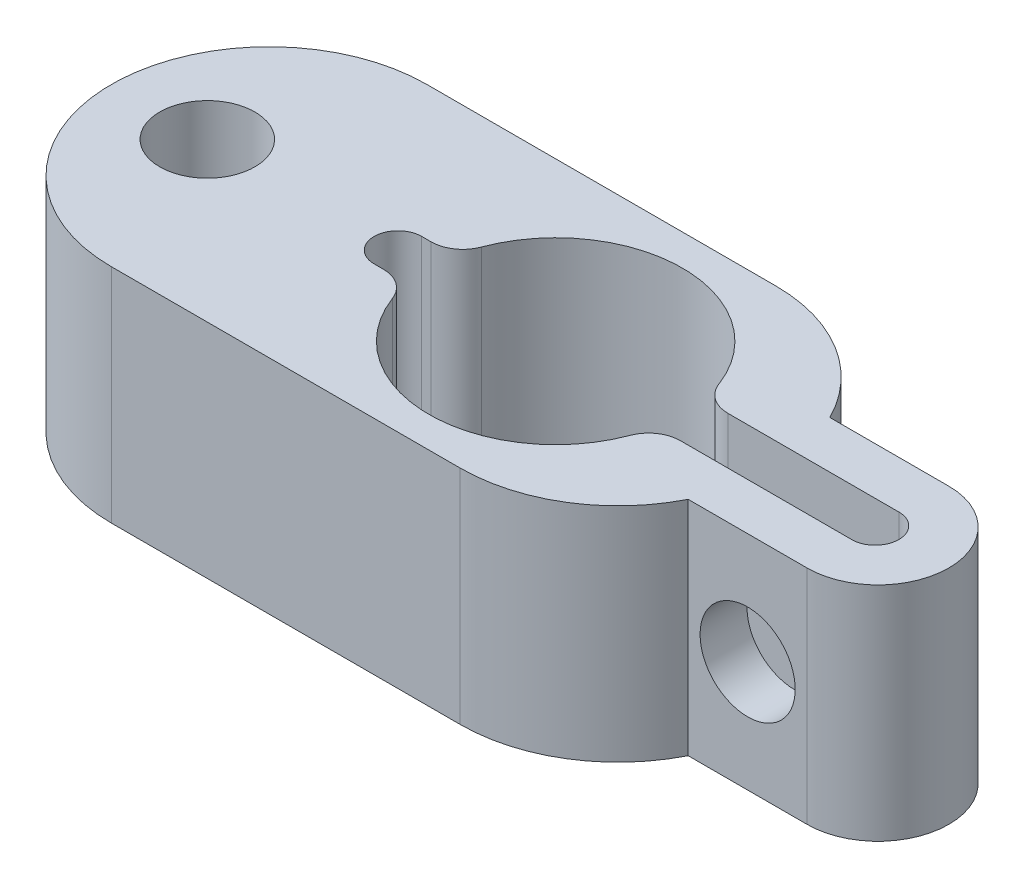
ISO-10303-21;
HEADER;
FILE_DESCRIPTION(('STEP AP214'),'2;1');
FILE_NAME('part.step','',(''),(''),'','','');
FILE_SCHEMA(('AUTOMOTIVE_DESIGN { 1 0 10303 214 1 1 1 1 }'));
ENDSEC;
DATA;
#1=APPLICATION_CONTEXT('core data for automotive mechanical design processes');
#2=APPLICATION_PROTOCOL_DEFINITION('international standard','automotive_design',2000,#1);
#3=PRODUCT_CONTEXT('',#1,'mechanical');
#4=PRODUCT('Part','Part','',(#3));
#5=PRODUCT_RELATED_PRODUCT_CATEGORY('part','',(#4));
#6=PRODUCT_DEFINITION_FORMATION('','',#4);
#7=PRODUCT_DEFINITION_CONTEXT('part definition',#1,'design');
#8=PRODUCT_DEFINITION('design','',#6,#7);
#9=PRODUCT_DEFINITION_SHAPE('','',#8);
#10=(LENGTH_UNIT() NAMED_UNIT(*) SI_UNIT(.MILLI.,.METRE.));
#11=(NAMED_UNIT(*) PLANE_ANGLE_UNIT() SI_UNIT($,.RADIAN.));
#12=(NAMED_UNIT(*) SI_UNIT($,.STERADIAN.) SOLID_ANGLE_UNIT());
#13=UNCERTAINTY_MEASURE_WITH_UNIT(LENGTH_MEASURE(1.E-05),#10,'distance_accuracy_value','');
#14=(GEOMETRIC_REPRESENTATION_CONTEXT(3) GLOBAL_UNCERTAINTY_ASSIGNED_CONTEXT((#13)) GLOBAL_UNIT_ASSIGNED_CONTEXT((#10,
#11,#12)) REPRESENTATION_CONTEXT('',''));
#15=CARTESIAN_POINT('',(0.,0.,0.));
#16=DIRECTION('',(0.,0.,1.));
#17=DIRECTION('',(1.,0.,0.));
#18=AXIS2_PLACEMENT_3D('',#15,#16,#17);
#19=CARTESIAN_POINT('',(-23.9579369166048,7.,0.));
#20=DIRECTION('',(0.,-1.,0.));
#21=DIRECTION('',(0.,0.,-1.));
#22=AXIS2_PLACEMENT_3D('',#19,#20,#21);
#23=CYLINDRICAL_SURFACE('',#22,4.97391267674292);
#24=CARTESIAN_POINT('',(-23.9579369166048,0.,0.));
#25=DIRECTION('',(0.,1.,0.));
#26=DIRECTION('',(0.,0.,1.));
#27=AXIS2_PLACEMENT_3D('',#24,#25,#26);
#28=CIRCLE('',#27,4.97391267674292);
#29=CARTESIAN_POINT('',(-19.5137803889829,0.,-2.23366964295527));
#30=VERTEX_POINT('',#29);
#31=CARTESIAN_POINT('',(-23.9579369166048,0.,-4.97391267674291));
#32=VERTEX_POINT('',#31);
#33=EDGE_CURVE('E193',#30,#32,#28,.T.);
#34=ORIENTED_EDGE('',*,*,#33,.T.);
#35=DIRECTION('',(0.,-1.,0.));
#36=VECTOR('',#35,1.);
#37=CARTESIAN_POINT('',(-23.9579369166048,7.,-4.97391267674291));
#38=LINE('',#37,#36);
#39=CARTESIAN_POINT('',(-23.9579369166048,7.,-4.97391267674291));
#40=VERTEX_POINT('',#39);
#41=EDGE_CURVE('E11',#40,#32,#38,.T.);
#42=ORIENTED_EDGE('',*,*,#41,.F.);
#43=CARTESIAN_POINT('',(-23.9579369166048,7.,0.));
#44=DIRECTION('',(0.,1.,0.));
#45=DIRECTION('',(0.,0.,1.));
#46=AXIS2_PLACEMENT_3D('',#43,#44,#45);
#47=CIRCLE('',#46,4.97391267674292);
#48=CARTESIAN_POINT('',(-19.5137803889829,7.,-2.23366964295527));
#49=VERTEX_POINT('',#48);
#50=EDGE_CURVE('E280',#49,#40,#47,.T.);
#51=ORIENTED_EDGE('',*,*,#50,.F.);
#52=DIRECTION('',(0.,-1.,0.));
#53=VECTOR('',#52,1.);
#54=CARTESIAN_POINT('',(-19.5137803889829,7.,-2.23366964295527));
#55=LINE('',#54,#53);
#56=EDGE_CURVE('E298',#49,#30,#55,.T.);
#57=ORIENTED_EDGE('',*,*,#56,.T.);
#58=EDGE_LOOP('',(#34,#42,#51,#57));
#59=FACE_BOUND('',#58,.T.);
#60=ADVANCED_FACE('F40',(#59),#23,.T.);
#61=CARTESIAN_POINT('',(-34.9579369166048,7.,-4.97391267674291));
#62=DIRECTION('',(0.,0.,1.));
#63=DIRECTION('',(1.,0.,0.));
#64=AXIS2_PLACEMENT_3D('',#61,#62,#63);
#65=PLANE('',#64);
#66=DIRECTION('',(-1.,0.,0.));
#67=VECTOR('',#66,1.);
#68=CARTESIAN_POINT('',(-34.9579369166048,0.,-4.97391267674291));
#69=LINE('',#68,#67);
#70=CARTESIAN_POINT('',(-34.9579369166048,0.,-4.97391267674291));
#71=VERTEX_POINT('',#70);
#72=EDGE_CURVE('E301',#32,#71,#69,.T.);
#73=ORIENTED_EDGE('',*,*,#72,.T.);
#74=DIRECTION('',(0.,-1.,0.));
#75=VECTOR('',#74,1.);
#76=CARTESIAN_POINT('',(-34.9579369166048,7.,-4.97391267674291));
#77=LINE('',#76,#75);
#78=CARTESIAN_POINT('',(-34.9579369166048,7.,-4.97391267674291));
#79=VERTEX_POINT('',#78);
#80=EDGE_CURVE('E48',#79,#71,#77,.T.);
#81=ORIENTED_EDGE('',*,*,#80,.F.);
#82=DIRECTION('',(-1.,0.,0.));
#83=VECTOR('',#82,1.);
#84=CARTESIAN_POINT('',(-34.9579369166048,7.,-4.97391267674291));
#85=LINE('',#84,#83);
#86=EDGE_CURVE('E283',#40,#79,#85,.T.);
#87=ORIENTED_EDGE('',*,*,#86,.F.);
#88=ORIENTED_EDGE('',*,*,#41,.T.);
#89=EDGE_LOOP('',(#73,#81,#87,#88));
#90=FACE_BOUND('',#89,.T.);
#91=ADVANCED_FACE('F358',(#90),#65,.F.);
#92=CARTESIAN_POINT('',(-34.9579369166048,7.,0.));
#93=DIRECTION('',(0.,-1.,0.));
#94=DIRECTION('',(0.,0.,-1.));
#95=AXIS2_PLACEMENT_3D('',#92,#93,#94);
#96=CYLINDRICAL_SURFACE('',#95,4.97391267674292);
#97=CARTESIAN_POINT('',(-34.9579369166048,0.,0.));
#98=DIRECTION('',(0.,1.,0.));
#99=DIRECTION('',(0.,0.,1.));
#100=AXIS2_PLACEMENT_3D('',#97,#98,#99);
#101=CIRCLE('',#100,4.97391267674292);
#102=CARTESIAN_POINT('',(-34.9579369166048,0.,4.97391267674293));
#103=VERTEX_POINT('',#102);
#104=EDGE_CURVE('E303',#71,#103,#101,.T.);
#105=ORIENTED_EDGE('',*,*,#104,.T.);
#106=DIRECTION('',(0.,-1.,0.));
#107=VECTOR('',#106,1.);
#108=CARTESIAN_POINT('',(-34.9579369166048,7.,4.97391267674293));
#109=LINE('',#108,#107);
#110=CARTESIAN_POINT('',(-34.9579369166048,7.,4.97391267674293));
#111=VERTEX_POINT('',#110);
#112=EDGE_CURVE('E328',#111,#103,#109,.T.);
#113=ORIENTED_EDGE('',*,*,#112,.F.);
#114=CARTESIAN_POINT('',(-34.9579369166048,7.,0.));
#115=DIRECTION('',(0.,1.,0.));
#116=DIRECTION('',(0.,0.,1.));
#117=AXIS2_PLACEMENT_3D('',#114,#115,#116);
#118=CIRCLE('',#117,4.97391267674292);
#119=EDGE_CURVE('E286',#79,#111,#118,.T.);
#120=ORIENTED_EDGE('',*,*,#119,.F.);
#121=ORIENTED_EDGE('',*,*,#80,.T.);
#122=EDGE_LOOP('',(#105,#113,#120,#121));
#123=FACE_BOUND('',#122,.T.);
#124=ADVANCED_FACE('F336',(#123),#96,.T.);
#125=CARTESIAN_POINT('',(-34.9579369166048,7.,4.97391267674293));
#126=DIRECTION('',(0.,0.,-1.));
#127=DIRECTION('',(-1.,0.,0.));
#128=AXIS2_PLACEMENT_3D('',#125,#126,#127);
#129=PLANE('',#128);
#130=DIRECTION('',(1.,0.,0.));
#131=VECTOR('',#130,1.);
#132=CARTESIAN_POINT('',(-34.9579369166048,0.,4.97391267674293));
#133=LINE('',#132,#131);
#134=CARTESIAN_POINT('',(-23.9579369166048,0.,4.97391267674293));
#135=VERTEX_POINT('',#134);
#136=EDGE_CURVE('E305',#103,#135,#133,.T.);
#137=ORIENTED_EDGE('',*,*,#136,.T.);
#138=DIRECTION('',(0.,-1.,0.));
#139=VECTOR('',#138,1.);
#140=CARTESIAN_POINT('',(-23.9579369166048,7.,4.97391267674293));
#141=LINE('',#140,#139);
#142=CARTESIAN_POINT('',(-23.9579369166048,7.,4.97391267674293));
#143=VERTEX_POINT('',#142);
#144=EDGE_CURVE('E325',#143,#135,#141,.T.);
#145=ORIENTED_EDGE('',*,*,#144,.F.);
#146=DIRECTION('',(1.,0.,0.));
#147=VECTOR('',#146,1.);
#148=CARTESIAN_POINT('',(-34.9579369166048,7.,4.97391267674293));
#149=LINE('',#148,#147);
#150=EDGE_CURVE('E288',#111,#143,#149,.T.);
#151=ORIENTED_EDGE('',*,*,#150,.F.);
#152=ORIENTED_EDGE('',*,*,#112,.T.);
#153=EDGE_LOOP('',(#137,#145,#151,#152));
#154=FACE_BOUND('',#153,.T.);
#155=ADVANCED_FACE('F347',(#154),#129,.F.);
#156=CARTESIAN_POINT('',(-23.9579369166048,7.,0.));
#157=DIRECTION('',(0.,-1.,0.));
#158=DIRECTION('',(0.,0.,-1.));
#159=AXIS2_PLACEMENT_3D('',#156,#157,#158);
#160=CYLINDRICAL_SURFACE('',#159,4.97391267674292);
#161=CARTESIAN_POINT('',(-23.9579369166048,0.,0.));
#162=DIRECTION('',(0.,1.,0.));
#163=DIRECTION('',(0.,0.,-1.));
#164=AXIS2_PLACEMENT_3D('',#161,#162,#163);
#165=CIRCLE('',#164,4.97391267674292);
#166=CARTESIAN_POINT('',(-19.5137803889829,0.,2.23366964295529));
#167=VERTEX_POINT('',#166);
#168=EDGE_CURVE('E307',#135,#167,#165,.T.);
#169=ORIENTED_EDGE('',*,*,#168,.T.);
#170=DIRECTION('',(0.,-1.,0.));
#171=VECTOR('',#170,1.);
#172=CARTESIAN_POINT('',(-19.5137803889829,7.,2.23366964295529));
#173=LINE('',#172,#171);
#174=CARTESIAN_POINT('',(-19.5137803889829,7.,2.23366964295529));
#175=VERTEX_POINT('',#174);
#176=EDGE_CURVE('E322',#175,#167,#173,.T.);
#177=ORIENTED_EDGE('',*,*,#176,.F.);
#178=CARTESIAN_POINT('',(-23.9579369166048,7.,0.));
#179=DIRECTION('',(0.,1.,0.));
#180=DIRECTION('',(0.,0.,-1.));
#181=AXIS2_PLACEMENT_3D('',#178,#179,#180);
#182=CIRCLE('',#181,4.97391267674292);
#183=EDGE_CURVE('E290',#143,#175,#182,.T.);
#184=ORIENTED_EDGE('',*,*,#183,.F.);
#185=ORIENTED_EDGE('',*,*,#144,.T.);
#186=EDGE_LOOP('',(#169,#177,#184,#185));
#187=FACE_BOUND('',#186,.T.);
#188=ADVANCED_FACE('F351',(#187),#160,.T.);
#189=CARTESIAN_POINT('',(-19.5137803889829,7.,2.23366964295529));
#190=DIRECTION('',(0.,0.,-1.));
#191=DIRECTION('',(-1.,0.,0.));
#192=AXIS2_PLACEMENT_3D('',#189,#190,#191);
#193=PLANE('',#192);
#194=CARTESIAN_POINT('',(-17.638780388983,3.5,2.23366964295528));
#195=DIRECTION('',(0.,0.,-1.));
#196=DIRECTION('',(-1.,0.,0.));
#197=AXIS2_PLACEMENT_3D('',#194,#195,#196);
#198=CIRCLE('',#197,1.5);
#199=CARTESIAN_POINT('',(-19.138780388983,3.5,2.23366964295529));
#200=VERTEX_POINT('',#199);
#201=EDGE_CURVE('E279',#200,#200,#198,.T.);
#202=ORIENTED_EDGE('',*,*,#201,.T.);
#203=EDGE_LOOP('',(#202));
#204=FACE_BOUND('',#203,.T.);
#205=DIRECTION('',(1.,0.,0.));
#206=VECTOR('',#205,1.);
#207=CARTESIAN_POINT('',(-19.5137803889829,0.,2.23366964295529));
#208=LINE('',#207,#206);
#209=CARTESIAN_POINT('',(-15.763780388983,0.,2.23366964295528));
#210=VERTEX_POINT('',#209);
#211=EDGE_CURVE('E309',#167,#210,#208,.T.);
#212=ORIENTED_EDGE('',*,*,#211,.T.);
#213=DIRECTION('',(0.,-1.,0.));
#214=VECTOR('',#213,1.);
#215=CARTESIAN_POINT('',(-15.763780388983,7.,2.23366964295528));
#216=LINE('',#215,#214);
#217=CARTESIAN_POINT('',(-15.763780388983,7.,2.23366964295528));
#218=VERTEX_POINT('',#217);
#219=EDGE_CURVE('E319',#218,#210,#216,.T.);
#220=ORIENTED_EDGE('',*,*,#219,.F.);
#221=DIRECTION('',(1.,0.,0.));
#222=VECTOR('',#221,1.);
#223=CARTESIAN_POINT('',(-19.5137803889829,7.,2.23366964295529));
#224=LINE('',#223,#222);
#225=EDGE_CURVE('E292',#175,#218,#224,.T.);
#226=ORIENTED_EDGE('',*,*,#225,.F.);
#227=ORIENTED_EDGE('',*,*,#176,.T.);
#228=EDGE_LOOP('',(#212,#220,#226,#227));
#229=FACE_BOUND('',#228,.T.);
#230=ADVANCED_FACE('F371',(#204,#229),#193,.F.);
#231=CARTESIAN_POINT('',(-15.763780388983,7.,0.));
#232=DIRECTION('',(0.,-1.,0.));
#233=DIRECTION('',(0.,0.,-1.));
#234=AXIS2_PLACEMENT_3D('',#231,#232,#233);
#235=CYLINDRICAL_SURFACE('',#234,2.23366964295527);
#236=CARTESIAN_POINT('',(-15.763780388983,0.,0.));
#237=DIRECTION('',(0.,1.,0.));
#238=DIRECTION('',(0.,0.,-1.));
#239=AXIS2_PLACEMENT_3D('',#236,#237,#238);
#240=CIRCLE('',#239,2.23366964295527);
#241=CARTESIAN_POINT('',(-15.763780388983,0.,-2.23366964295526));
#242=VERTEX_POINT('',#241);
#243=EDGE_CURVE('E311',#210,#242,#240,.T.);
#244=ORIENTED_EDGE('',*,*,#243,.T.);
#245=DIRECTION('',(0.,-1.,0.));
#246=VECTOR('',#245,1.);
#247=CARTESIAN_POINT('',(-15.763780388983,7.,-2.23366964295526));
#248=LINE('',#247,#246);
#249=CARTESIAN_POINT('',(-15.763780388983,7.,-2.23366964295526));
#250=VERTEX_POINT('',#249);
#251=EDGE_CURVE('E316',#250,#242,#248,.T.);
#252=ORIENTED_EDGE('',*,*,#251,.F.);
#253=CARTESIAN_POINT('',(-15.763780388983,7.,0.));
#254=DIRECTION('',(0.,1.,0.));
#255=DIRECTION('',(0.,0.,-1.));
#256=AXIS2_PLACEMENT_3D('',#253,#254,#255);
#257=CIRCLE('',#256,2.23366964295527);
#258=EDGE_CURVE('E294',#218,#250,#257,.T.);
#259=ORIENTED_EDGE('',*,*,#258,.F.);
#260=ORIENTED_EDGE('',*,*,#219,.T.);
#261=EDGE_LOOP('',(#244,#252,#259,#260));
#262=FACE_BOUND('',#261,.T.);
#263=ADVANCED_FACE('F369',(#262),#235,.T.);
#264=CARTESIAN_POINT('',(-19.5137803889829,7.,-2.23366964295527));
#265=DIRECTION('',(0.,0.,1.));
#266=DIRECTION('',(1.,0.,0.));
#267=AXIS2_PLACEMENT_3D('',#264,#265,#266);
#268=PLANE('',#267);
#269=CARTESIAN_POINT('',(-17.638780388983,3.5,-2.23366964295527));
#270=DIRECTION('',(0.,0.,-1.));
#271=DIRECTION('',(-1.,0.,0.));
#272=AXIS2_PLACEMENT_3D('',#269,#270,#271);
#273=CIRCLE('',#272,1.5);
#274=CARTESIAN_POINT('',(-19.138780388983,3.5,-2.23366964295527));
#275=VERTEX_POINT('',#274);
#276=EDGE_CURVE('E656',#275,#275,#273,.T.);
#277=ORIENTED_EDGE('',*,*,#276,.F.);
#278=EDGE_LOOP('',(#277));
#279=FACE_BOUND('',#278,.T.);
#280=DIRECTION('',(-1.,0.,0.));
#281=VECTOR('',#280,1.);
#282=CARTESIAN_POINT('',(-19.5137803889829,0.,-2.23366964295527));
#283=LINE('',#282,#281);
#284=EDGE_CURVE('E284',#242,#30,#283,.T.);
#285=ORIENTED_EDGE('',*,*,#284,.T.);
#286=ORIENTED_EDGE('',*,*,#56,.F.);
#287=DIRECTION('',(-1.,0.,0.));
#288=VECTOR('',#287,1.);
#289=CARTESIAN_POINT('',(-19.5137803889829,7.,-2.23366964295527));
#290=LINE('',#289,#288);
#291=EDGE_CURVE('E296',#250,#49,#290,.T.);
#292=ORIENTED_EDGE('',*,*,#291,.F.);
#293=ORIENTED_EDGE('',*,*,#251,.T.);
#294=EDGE_LOOP('',(#285,#286,#292,#293));
#295=FACE_BOUND('',#294,.T.);
#296=ADVANCED_FACE('F364',(#279,#295),#268,.F.);
#297=CARTESIAN_POINT('',(-23.9579369166048,7.,0.));
#298=DIRECTION('',(0.,1.,0.));
#299=DIRECTION('',(0.,0.,1.));
#300=AXIS2_PLACEMENT_3D('',#297,#298,#299);
#301=PLANE('',#300);
#302=DIRECTION('',(-1.,0.,0.));
#303=VECTOR('',#302,1.);
#304=CARTESIAN_POINT('',(-15.843921165916,7.,-0.741089379823582));
#305=LINE('',#304,#303);
#306=CARTESIAN_POINT('',(-15.843921165916,7.,-0.741089379823582));
#307=VERTEX_POINT('',#306);
#308=CARTESIAN_POINT('',(-21.2370801515324,7.,-0.741089379823581));
#309=VERTEX_POINT('',#308);
#310=EDGE_CURVE('E185',#307,#309,#305,.T.);
#311=ORIENTED_EDGE('',*,*,#310,.F.);
#312=CARTESIAN_POINT('',(-15.843921165916,7.,0.00891062017641825));
#313=DIRECTION('',(0.,1.,0.));
#314=DIRECTION('',(0.,0.,1.));
#315=AXIS2_PLACEMENT_3D('',#312,#313,#314);
#316=CIRCLE('',#315,0.750000000000001);
#317=CARTESIAN_POINT('',(-15.763780388983,7.,0.754616631867736));
#318=VERTEX_POINT('',#317);
#319=EDGE_CURVE('E177',#318,#307,#316,.T.);
#320=ORIENTED_EDGE('',*,*,#319,.F.);
#321=DIRECTION('',(1.,0.,0.));
#322=VECTOR('',#321,1.);
#323=CARTESIAN_POINT('',(-15.763780388983,7.,0.754616631867736));
#324=LINE('',#323,#322);
#325=CARTESIAN_POINT('',(-21.2377266569176,7.,0.754616631867737));
#326=VERTEX_POINT('',#325);
#327=EDGE_CURVE('E221',#326,#318,#324,.T.);
#328=ORIENTED_EDGE('',*,*,#327,.F.);
#329=CARTESIAN_POINT('',(-21.2377266569176,7.,1.75461663186774));
#330=DIRECTION('',(0.,-1.,0.));
#331=DIRECTION('',(0.,0.,1.));
#332=AXIS2_PLACEMENT_3D('',#329,#330,#331);
#333=CIRCLE('',#332,1.);
#334=CARTESIAN_POINT('',(-22.1744763566774,7.,1.40461663186774));
#335=VERTEX_POINT('',#334);
#336=EDGE_CURVE('E219',#335,#326,#333,.T.);
#337=ORIENTED_EDGE('',*,*,#336,.F.);
#338=CARTESIAN_POINT('',(-25.918050981137,7.,0.00589601429305532));
#339=DIRECTION('',(0.,1.,0.));
#340=DIRECTION('',(0.,0.,-1.));
#341=AXIS2_PLACEMENT_3D('',#338,#339,#340);
#342=CIRCLE('',#341,3.99634462164195);
#343=CARTESIAN_POINT('',(-29.6612431011973,7.,1.40563995060606));
#344=VERTEX_POINT('',#343);
#345=EDGE_CURVE('E217',#344,#335,#342,.T.);
#346=ORIENTED_EDGE('',*,*,#345,.F.);
#347=CARTESIAN_POINT('',(-30.5978970873899,7.,1.75589601429306));
#348=DIRECTION('',(0.,-1.,0.));
#349=DIRECTION('',(0.,0.,-1.));
#350=AXIS2_PLACEMENT_3D('',#347,#348,#349);
#351=CIRCLE('',#350,1.);
#352=CARTESIAN_POINT('',(-30.5978970873899,7.,0.755896014293056));
#353=VERTEX_POINT('',#352);
#354=EDGE_CURVE('E215',#353,#344,#351,.T.);
#355=ORIENTED_EDGE('',*,*,#354,.F.);
#356=DIRECTION('',(1.,0.,0.));
#357=VECTOR('',#356,1.);
#358=CARTESIAN_POINT('',(-30.5978970873899,7.,0.755896014293056));
#359=LINE('',#358,#357);
#360=CARTESIAN_POINT('',(-30.8906440954293,7.,0.755896014293056));
#361=VERTEX_POINT('',#360);
#362=EDGE_CURVE('E213',#361,#353,#359,.T.);
#363=ORIENTED_EDGE('',*,*,#362,.F.);
#364=CARTESIAN_POINT('',(-30.8906440954293,7.,0.00589601429305596));
#365=DIRECTION('',(0.,1.,0.));
#366=DIRECTION('',(0.,0.,-1.));
#367=AXIS2_PLACEMENT_3D('',#364,#365,#366);
#368=CIRCLE('',#367,0.75);
#369=CARTESIAN_POINT('',(-30.8906440954293,7.,-0.744103985706944));
#370=VERTEX_POINT('',#369);
#371=EDGE_CURVE('E211',#370,#361,#368,.T.);
#372=ORIENTED_EDGE('',*,*,#371,.F.);
#373=DIRECTION('',(-1.,0.,0.));
#374=VECTOR('',#373,1.);
#375=CARTESIAN_POINT('',(-30.8906440954293,7.,-0.744103985706944));
#376=LINE('',#375,#374);
#377=CARTESIAN_POINT('',(-30.5978970873899,7.,-0.744103985706944));
#378=VERTEX_POINT('',#377);
#379=EDGE_CURVE('E209',#378,#370,#376,.T.);
#380=ORIENTED_EDGE('',*,*,#379,.F.);
#381=CARTESIAN_POINT('',(-30.5978970873899,7.,-1.74410398570694));
#382=DIRECTION('',(0.,-1.,0.));
#383=DIRECTION('',(0.,0.,1.));
#384=AXIS2_PLACEMENT_3D('',#381,#382,#383);
#385=CIRCLE('',#384,1.);
#386=CARTESIAN_POINT('',(-29.6612431011973,7.,-1.39384792201995));
#387=VERTEX_POINT('',#386);
#388=EDGE_CURVE('E207',#387,#378,#385,.T.);
#389=ORIENTED_EDGE('',*,*,#388,.F.);
#390=CARTESIAN_POINT('',(-25.918050981137,7.,0.00589601429305532));
#391=DIRECTION('',(0.,1.,0.));
#392=DIRECTION('',(0.,0.,1.));
#393=AXIS2_PLACEMENT_3D('',#390,#391,#392);
#394=CIRCLE('',#393,3.99634462164195);
#395=CARTESIAN_POINT('',(-22.1744763566774,7.,-1.39282460328163));
#396=VERTEX_POINT('',#395);
#397=EDGE_CURVE('E202',#396,#387,#394,.T.);
#398=ORIENTED_EDGE('',*,*,#397,.F.);
#399=CARTESIAN_POINT('',(-21.2370801515324,7.,-1.74108937982358));
#400=DIRECTION('',(0.,-1.,0.));
#401=DIRECTION('',(0.,0.,1.));
#402=AXIS2_PLACEMENT_3D('',#399,#400,#401);
#403=CIRCLE('',#402,1.);
#404=EDGE_CURVE('E200',#309,#396,#403,.T.);
#405=ORIENTED_EDGE('',*,*,#404,.F.);
#406=EDGE_LOOP('',(#311,#320,#328,#337,#346,#355,#363,#372,#380,#389,#398,#405));
#407=FACE_BOUND('',#406,.T.);
#408=CARTESIAN_POINT('',(-36.918050981137,7.,-0.0133436525686305));
#409=DIRECTION('',(0.,1.,0.));
#410=DIRECTION('',(0.,0.,1.));
#411=AXIS2_PLACEMENT_3D('',#408,#409,#410);
#412=CIRCLE('',#411,1.5);
#413=CARTESIAN_POINT('',(-36.918050981137,7.,1.48665634743137));
#414=VERTEX_POINT('',#413);
#415=EDGE_CURVE('E276',#414,#414,#412,.T.);
#416=ORIENTED_EDGE('',*,*,#415,.F.);
#417=EDGE_LOOP('',(#416));
#418=FACE_BOUND('',#417,.T.);
#419=ORIENTED_EDGE('',*,*,#50,.T.);
#420=ORIENTED_EDGE('',*,*,#86,.T.);
#421=ORIENTED_EDGE('',*,*,#119,.T.);
#422=ORIENTED_EDGE('',*,*,#150,.T.);
#423=ORIENTED_EDGE('',*,*,#183,.T.);
#424=ORIENTED_EDGE('',*,*,#225,.T.);
#425=ORIENTED_EDGE('',*,*,#258,.T.);
#426=ORIENTED_EDGE('',*,*,#291,.T.);
#427=EDGE_LOOP('',(#419,#420,#421,#422,#423,#424,#425,#426));
#428=FACE_BOUND('',#427,.T.);
#429=ADVANCED_FACE('F197',(#407,#418,#428),#301,.T.);
#430=CARTESIAN_POINT('',(-23.9579369166048,0.,0.));
#431=DIRECTION('',(0.,1.,0.));
#432=DIRECTION('',(0.,0.,1.));
#433=AXIS2_PLACEMENT_3D('',#430,#431,#432);
#434=PLANE('',#433);
#435=CARTESIAN_POINT('',(-15.843921165916,0.,0.00891062017641825));
#436=DIRECTION('',(0.,1.,0.));
#437=DIRECTION('',(0.,0.,1.));
#438=AXIS2_PLACEMENT_3D('',#435,#436,#437);
#439=CIRCLE('',#438,0.750000000000001);
#440=CARTESIAN_POINT('',(-15.763780388983,0.,0.754616631867736));
#441=VERTEX_POINT('',#440);
#442=CARTESIAN_POINT('',(-15.843921165916,0.,-0.741089379823582));
#443=VERTEX_POINT('',#442);
#444=EDGE_CURVE('E63',#441,#443,#439,.T.);
#445=ORIENTED_EDGE('',*,*,#444,.T.);
#446=DIRECTION('',(-1.,0.,0.));
#447=VECTOR('',#446,1.);
#448=CARTESIAN_POINT('',(-15.843921165916,0.,-0.741089379823582));
#449=LINE('',#448,#447);
#450=CARTESIAN_POINT('',(-21.2370801515324,0.,-0.741089379823581));
#451=VERTEX_POINT('',#450);
#452=EDGE_CURVE('E192',#443,#451,#449,.T.);
#453=ORIENTED_EDGE('',*,*,#452,.T.);
#454=CARTESIAN_POINT('',(-21.2370801515324,0.,-1.74108937982358));
#455=DIRECTION('',(0.,-1.,0.));
#456=DIRECTION('',(0.,0.,1.));
#457=AXIS2_PLACEMENT_3D('',#454,#455,#456);
#458=CIRCLE('',#457,1.);
#459=CARTESIAN_POINT('',(-22.1744763566774,0.,-1.39282460328163));
#460=VERTEX_POINT('',#459);
#461=EDGE_CURVE('E226',#451,#460,#458,.T.);
#462=ORIENTED_EDGE('',*,*,#461,.T.);
#463=CARTESIAN_POINT('',(-25.918050981137,0.,0.00589601429305532));
#464=DIRECTION('',(0.,1.,0.));
#465=DIRECTION('',(0.,0.,1.));
#466=AXIS2_PLACEMENT_3D('',#463,#464,#465);
#467=CIRCLE('',#466,3.99634462164195);
#468=CARTESIAN_POINT('',(-29.6612431011973,0.,-1.39384792201995));
#469=VERTEX_POINT('',#468);
#470=EDGE_CURVE('E229',#460,#469,#467,.T.);
#471=ORIENTED_EDGE('',*,*,#470,.T.);
#472=CARTESIAN_POINT('',(-30.5978970873899,0.,-1.74410398570694));
#473=DIRECTION('',(0.,-1.,0.));
#474=DIRECTION('',(0.,0.,1.));
#475=AXIS2_PLACEMENT_3D('',#472,#473,#474);
#476=CIRCLE('',#475,1.);
#477=CARTESIAN_POINT('',(-30.5978970873899,0.,-0.744103985706944));
#478=VERTEX_POINT('',#477);
#479=EDGE_CURVE('E232',#469,#478,#476,.T.);
#480=ORIENTED_EDGE('',*,*,#479,.T.);
#481=DIRECTION('',(-1.,0.,0.));
#482=VECTOR('',#481,1.);
#483=CARTESIAN_POINT('',(-30.8906440954293,0.,-0.744103985706944));
#484=LINE('',#483,#482);
#485=CARTESIAN_POINT('',(-30.8906440954293,0.,-0.744103985706944));
#486=VERTEX_POINT('',#485);
#487=EDGE_CURVE('E235',#478,#486,#484,.T.);
#488=ORIENTED_EDGE('',*,*,#487,.T.);
#489=CARTESIAN_POINT('',(-30.8906440954293,0.,0.00589601429305596));
#490=DIRECTION('',(0.,1.,0.));
#491=DIRECTION('',(0.,0.,-1.));
#492=AXIS2_PLACEMENT_3D('',#489,#490,#491);
#493=CIRCLE('',#492,0.75);
#494=CARTESIAN_POINT('',(-30.8906440954293,0.,0.755896014293056));
#495=VERTEX_POINT('',#494);
#496=EDGE_CURVE('E238',#486,#495,#493,.T.);
#497=ORIENTED_EDGE('',*,*,#496,.T.);
#498=DIRECTION('',(1.,0.,0.));
#499=VECTOR('',#498,1.);
#500=CARTESIAN_POINT('',(-30.5978970873899,0.,0.755896014293056));
#501=LINE('',#500,#499);
#502=CARTESIAN_POINT('',(-30.5978970873899,0.,0.755896014293056));
#503=VERTEX_POINT('',#502);
#504=EDGE_CURVE('E241',#495,#503,#501,.T.);
#505=ORIENTED_EDGE('',*,*,#504,.T.);
#506=CARTESIAN_POINT('',(-30.5978970873899,0.,1.75589601429306));
#507=DIRECTION('',(0.,-1.,0.));
#508=DIRECTION('',(0.,0.,-1.));
#509=AXIS2_PLACEMENT_3D('',#506,#507,#508);
#510=CIRCLE('',#509,1.);
#511=CARTESIAN_POINT('',(-29.6612431011973,0.,1.40563995060606));
#512=VERTEX_POINT('',#511);
#513=EDGE_CURVE('E244',#503,#512,#510,.T.);
#514=ORIENTED_EDGE('',*,*,#513,.T.);
#515=CARTESIAN_POINT('',(-25.918050981137,0.,0.00589601429305532));
#516=DIRECTION('',(0.,1.,0.));
#517=DIRECTION('',(0.,0.,-1.));
#518=AXIS2_PLACEMENT_3D('',#515,#516,#517);
#519=CIRCLE('',#518,3.99634462164195);
#520=CARTESIAN_POINT('',(-22.1744763566774,0.,1.40461663186774));
#521=VERTEX_POINT('',#520);
#522=EDGE_CURVE('E247',#512,#521,#519,.T.);
#523=ORIENTED_EDGE('',*,*,#522,.T.);
#524=CARTESIAN_POINT('',(-21.2377266569176,0.,1.75461663186774));
#525=DIRECTION('',(0.,-1.,0.));
#526=DIRECTION('',(0.,0.,1.));
#527=AXIS2_PLACEMENT_3D('',#524,#525,#526);
#528=CIRCLE('',#527,1.);
#529=CARTESIAN_POINT('',(-21.2377266569176,0.,0.754616631867737));
#530=VERTEX_POINT('',#529);
#531=EDGE_CURVE('E250',#521,#530,#528,.T.);
#532=ORIENTED_EDGE('',*,*,#531,.T.);
#533=DIRECTION('',(1.,0.,0.));
#534=VECTOR('',#533,1.);
#535=CARTESIAN_POINT('',(-15.763780388983,0.,0.754616631867736));
#536=LINE('',#535,#534);
#537=EDGE_CURVE('E186',#530,#441,#536,.T.);
#538=ORIENTED_EDGE('',*,*,#537,.T.);
#539=EDGE_LOOP('',(#445,#453,#462,#471,#480,#488,#497,#505,#514,#523,#532,#538));
#540=FACE_BOUND('',#539,.T.);
#541=CARTESIAN_POINT('',(-36.918050981137,0.,-0.0133436525686305));
#542=DIRECTION('',(0.,1.,0.));
#543=DIRECTION('',(0.,0.,1.));
#544=AXIS2_PLACEMENT_3D('',#541,#542,#543);
#545=CIRCLE('',#544,1.5);
#546=CARTESIAN_POINT('',(-36.918050981137,0.,1.48665634743137));
#547=VERTEX_POINT('',#546);
#548=EDGE_CURVE('E224',#547,#547,#545,.T.);
#549=ORIENTED_EDGE('',*,*,#548,.T.);
#550=EDGE_LOOP('',(#549));
#551=FACE_BOUND('',#550,.T.);
#552=ORIENTED_EDGE('',*,*,#33,.F.);
#553=ORIENTED_EDGE('',*,*,#284,.F.);
#554=ORIENTED_EDGE('',*,*,#243,.F.);
#555=ORIENTED_EDGE('',*,*,#211,.F.);
#556=ORIENTED_EDGE('',*,*,#168,.F.);
#557=ORIENTED_EDGE('',*,*,#136,.F.);
#558=ORIENTED_EDGE('',*,*,#104,.F.);
#559=ORIENTED_EDGE('',*,*,#72,.F.);
#560=EDGE_LOOP('',(#552,#553,#554,#555,#556,#557,#558,#559));
#561=FACE_BOUND('',#560,.T.);
#562=ADVANCED_FACE('F342',(#540,#551,#561),#434,.F.);
#563=CARTESIAN_POINT('',(-36.918050981137,7.,-0.0133436525686305));
#564=DIRECTION('',(0.,-1.,0.));
#565=DIRECTION('',(0.,0.,-1.));
#566=AXIS2_PLACEMENT_3D('',#563,#564,#565);
#567=CYLINDRICAL_SURFACE('',#566,1.5);
#568=ORIENTED_EDGE('',*,*,#415,.T.);
#569=EDGE_LOOP('',(#568));
#570=FACE_BOUND('',#569,.T.);
#571=ORIENTED_EDGE('',*,*,#548,.F.);
#572=EDGE_LOOP('',(#571));
#573=FACE_BOUND('',#572,.T.);
#574=ADVANCED_FACE('F429',(#570,#573),#567,.F.);
#575=CARTESIAN_POINT('',(-15.843921165916,7.,0.00891062017641825));
#576=DIRECTION('',(0.,-1.,0.));
#577=DIRECTION('',(0.,0.,-1.));
#578=AXIS2_PLACEMENT_3D('',#575,#576,#577);
#579=CYLINDRICAL_SURFACE('',#578,0.750000000000001);
#580=ORIENTED_EDGE('',*,*,#444,.F.);
#581=DIRECTION('',(0.,-1.,0.));
#582=VECTOR('',#581,1.);
#583=CARTESIAN_POINT('',(-15.763780388983,7.,0.754616631867736));
#584=LINE('',#583,#582);
#585=EDGE_CURVE('E181',#318,#441,#584,.T.);
#586=ORIENTED_EDGE('',*,*,#585,.F.);
#587=ORIENTED_EDGE('',*,*,#319,.T.);
#588=DIRECTION('',(0.,-1.,0.));
#589=VECTOR('',#588,1.);
#590=CARTESIAN_POINT('',(-15.843921165916,7.,-0.741089379823582));
#591=LINE('',#590,#589);
#592=EDGE_CURVE('E180',#307,#443,#591,.T.);
#593=ORIENTED_EDGE('',*,*,#592,.T.);
#594=EDGE_LOOP('',(#580,#586,#587,#593));
#595=FACE_BOUND('',#594,.T.);
#596=ADVANCED_FACE('F179',(#595),#579,.F.);
#597=CARTESIAN_POINT('',(-15.843921165916,7.,-0.741089379823582));
#598=DIRECTION('',(0.,0.,1.));
#599=DIRECTION('',(1.,0.,0.));
#600=AXIS2_PLACEMENT_3D('',#597,#598,#599);
#601=PLANE('',#600);
#602=CARTESIAN_POINT('',(-17.638780388983,3.5,-0.741089379823582));
#603=DIRECTION('',(0.,0.,1.));
#604=DIRECTION('',(1.,0.,0.));
#605=AXIS2_PLACEMENT_3D('',#602,#603,#604);
#606=CIRCLE('',#605,1.5);
#607=CARTESIAN_POINT('',(-16.138780388983,3.5,-0.741089379823582));
#608=VERTEX_POINT('',#607);
#609=EDGE_CURVE('E653',#608,#608,#606,.T.);
#610=ORIENTED_EDGE('',*,*,#609,.F.);
#611=EDGE_LOOP('',(#610));
#612=FACE_BOUND('',#611,.T.);
#613=ORIENTED_EDGE('',*,*,#452,.F.);
#614=ORIENTED_EDGE('',*,*,#592,.F.);
#615=ORIENTED_EDGE('',*,*,#310,.T.);
#616=DIRECTION('',(0.,-1.,0.));
#617=VECTOR('',#616,1.);
#618=CARTESIAN_POINT('',(-21.2370801515324,7.,-0.741089379823581));
#619=LINE('',#618,#617);
#620=EDGE_CURVE('E194',#309,#451,#619,.T.);
#621=ORIENTED_EDGE('',*,*,#620,.T.);
#622=EDGE_LOOP('',(#613,#614,#615,#621));
#623=FACE_BOUND('',#622,.T.);
#624=ADVANCED_FACE('F189',(#612,#623),#601,.T.);
#625=CARTESIAN_POINT('',(-21.2370801515324,7.,-1.74108937982358));
#626=DIRECTION('',(0.,-1.,0.));
#627=DIRECTION('',(0.,0.,-1.));
#628=AXIS2_PLACEMENT_3D('',#625,#626,#627);
#629=CYLINDRICAL_SURFACE('',#628,1.);
#630=ORIENTED_EDGE('',*,*,#461,.F.);
#631=ORIENTED_EDGE('',*,*,#620,.F.);
#632=ORIENTED_EDGE('',*,*,#404,.T.);
#633=DIRECTION('',(0.,-1.,0.));
#634=VECTOR('',#633,1.);
#635=CARTESIAN_POINT('',(-22.1744763566774,7.,-1.39282460328163));
#636=LINE('',#635,#634);
#637=EDGE_CURVE('E271',#396,#460,#636,.T.);
#638=ORIENTED_EDGE('',*,*,#637,.T.);
#639=EDGE_LOOP('',(#630,#631,#632,#638));
#640=FACE_BOUND('',#639,.T.);
#641=ADVANCED_FACE('F457',(#640),#629,.T.);
#642=CARTESIAN_POINT('',(-25.918050981137,7.,0.00589601429305532));
#643=DIRECTION('',(0.,-1.,0.));
#644=DIRECTION('',(0.,0.,-1.));
#645=AXIS2_PLACEMENT_3D('',#642,#643,#644);
#646=CYLINDRICAL_SURFACE('',#645,3.99634462164195);
#647=ORIENTED_EDGE('',*,*,#470,.F.);
#648=ORIENTED_EDGE('',*,*,#637,.F.);
#649=ORIENTED_EDGE('',*,*,#397,.T.);
#650=DIRECTION('',(0.,-1.,0.));
#651=VECTOR('',#650,1.);
#652=CARTESIAN_POINT('',(-29.6612431011973,7.,-1.39384792201995));
#653=LINE('',#652,#651);
#654=EDGE_CURVE('E269',#387,#469,#653,.T.);
#655=ORIENTED_EDGE('',*,*,#654,.T.);
#656=EDGE_LOOP('',(#647,#648,#649,#655));
#657=FACE_BOUND('',#656,.T.);
#658=ADVANCED_FACE('F462',(#657),#646,.F.);
#659=CARTESIAN_POINT('',(-30.5978970873899,7.,-1.74410398570694));
#660=DIRECTION('',(0.,-1.,0.));
#661=DIRECTION('',(0.,0.,-1.));
#662=AXIS2_PLACEMENT_3D('',#659,#660,#661);
#663=CYLINDRICAL_SURFACE('',#662,1.);
#664=ORIENTED_EDGE('',*,*,#479,.F.);
#665=ORIENTED_EDGE('',*,*,#654,.F.);
#666=ORIENTED_EDGE('',*,*,#388,.T.);
#667=DIRECTION('',(0.,-1.,0.));
#668=VECTOR('',#667,1.);
#669=CARTESIAN_POINT('',(-30.5978970873899,7.,-0.744103985706944));
#670=LINE('',#669,#668);
#671=EDGE_CURVE('E267',#378,#478,#670,.T.);
#672=ORIENTED_EDGE('',*,*,#671,.T.);
#673=EDGE_LOOP('',(#664,#665,#666,#672));
#674=FACE_BOUND('',#673,.T.);
#675=ADVANCED_FACE('F473',(#674),#663,.T.);
#676=CARTESIAN_POINT('',(-30.8906440954293,7.,-0.744103985706944));
#677=DIRECTION('',(0.,0.,1.));
#678=DIRECTION('',(1.,0.,0.));
#679=AXIS2_PLACEMENT_3D('',#676,#677,#678);
#680=PLANE('',#679);
#681=ORIENTED_EDGE('',*,*,#487,.F.);
#682=ORIENTED_EDGE('',*,*,#671,.F.);
#683=ORIENTED_EDGE('',*,*,#379,.T.);
#684=DIRECTION('',(0.,-1.,0.));
#685=VECTOR('',#684,1.);
#686=CARTESIAN_POINT('',(-30.8906440954293,7.,-0.744103985706944));
#687=LINE('',#686,#685);
#688=EDGE_CURVE('E265',#370,#486,#687,.T.);
#689=ORIENTED_EDGE('',*,*,#688,.T.);
#690=EDGE_LOOP('',(#681,#682,#683,#689));
#691=FACE_BOUND('',#690,.T.);
#692=ADVANCED_FACE('F484',(#691),#680,.T.);
#693=CARTESIAN_POINT('',(-30.8906440954293,7.,0.00589601429305596));
#694=DIRECTION('',(0.,-1.,0.));
#695=DIRECTION('',(0.,0.,-1.));
#696=AXIS2_PLACEMENT_3D('',#693,#694,#695);
#697=CYLINDRICAL_SURFACE('',#696,0.75);
#698=ORIENTED_EDGE('',*,*,#496,.F.);
#699=ORIENTED_EDGE('',*,*,#688,.F.);
#700=ORIENTED_EDGE('',*,*,#371,.T.);
#701=DIRECTION('',(0.,-1.,0.));
#702=VECTOR('',#701,1.);
#703=CARTESIAN_POINT('',(-30.8906440954293,7.,0.755896014293056));
#704=LINE('',#703,#702);
#705=EDGE_CURVE('E263',#361,#495,#704,.T.);
#706=ORIENTED_EDGE('',*,*,#705,.T.);
#707=EDGE_LOOP('',(#698,#699,#700,#706));
#708=FACE_BOUND('',#707,.T.);
#709=ADVANCED_FACE('F495',(#708),#697,.F.);
#710=CARTESIAN_POINT('',(-30.5978970873899,7.,0.755896014293056));
#711=DIRECTION('',(0.,0.,-1.));
#712=DIRECTION('',(-1.,0.,0.));
#713=AXIS2_PLACEMENT_3D('',#710,#711,#712);
#714=PLANE('',#713);
#715=ORIENTED_EDGE('',*,*,#504,.F.);
#716=ORIENTED_EDGE('',*,*,#705,.F.);
#717=ORIENTED_EDGE('',*,*,#362,.T.);
#718=DIRECTION('',(0.,-1.,0.));
#719=VECTOR('',#718,1.);
#720=CARTESIAN_POINT('',(-30.5978970873899,7.,0.755896014293056));
#721=LINE('',#720,#719);
#722=EDGE_CURVE('E261',#353,#503,#721,.T.);
#723=ORIENTED_EDGE('',*,*,#722,.T.);
#724=EDGE_LOOP('',(#715,#716,#717,#723));
#725=FACE_BOUND('',#724,.T.);
#726=ADVANCED_FACE('F506',(#725),#714,.T.);
#727=CARTESIAN_POINT('',(-30.5978970873899,7.,1.75589601429306));
#728=DIRECTION('',(0.,-1.,0.));
#729=DIRECTION('',(0.,0.,-1.));
#730=AXIS2_PLACEMENT_3D('',#727,#728,#729);
#731=CYLINDRICAL_SURFACE('',#730,1.);
#732=ORIENTED_EDGE('',*,*,#513,.F.);
#733=ORIENTED_EDGE('',*,*,#722,.F.);
#734=ORIENTED_EDGE('',*,*,#354,.T.);
#735=DIRECTION('',(0.,-1.,0.));
#736=VECTOR('',#735,1.);
#737=CARTESIAN_POINT('',(-29.6612431011973,7.,1.40563995060606));
#738=LINE('',#737,#736);
#739=EDGE_CURVE('E259',#344,#512,#738,.T.);
#740=ORIENTED_EDGE('',*,*,#739,.T.);
#741=EDGE_LOOP('',(#732,#733,#734,#740));
#742=FACE_BOUND('',#741,.T.);
#743=ADVANCED_FACE('F517',(#742),#731,.T.);
#744=CARTESIAN_POINT('',(-25.918050981137,7.,0.00589601429305532));
#745=DIRECTION('',(0.,-1.,0.));
#746=DIRECTION('',(0.,0.,-1.));
#747=AXIS2_PLACEMENT_3D('',#744,#745,#746);
#748=CYLINDRICAL_SURFACE('',#747,3.99634462164195);
#749=ORIENTED_EDGE('',*,*,#522,.F.);
#750=ORIENTED_EDGE('',*,*,#739,.F.);
#751=ORIENTED_EDGE('',*,*,#345,.T.);
#752=DIRECTION('',(0.,-1.,0.));
#753=VECTOR('',#752,1.);
#754=CARTESIAN_POINT('',(-22.1744763566774,7.,1.40461663186774));
#755=LINE('',#754,#753);
#756=EDGE_CURVE('E257',#335,#521,#755,.T.);
#757=ORIENTED_EDGE('',*,*,#756,.T.);
#758=EDGE_LOOP('',(#749,#750,#751,#757));
#759=FACE_BOUND('',#758,.T.);
#760=ADVANCED_FACE('F528',(#759),#748,.F.);
#761=CARTESIAN_POINT('',(-21.2377266569176,7.,1.75461663186774));
#762=DIRECTION('',(0.,-1.,0.));
#763=DIRECTION('',(0.,0.,-1.));
#764=AXIS2_PLACEMENT_3D('',#761,#762,#763);
#765=CYLINDRICAL_SURFACE('',#764,1.);
#766=ORIENTED_EDGE('',*,*,#531,.F.);
#767=ORIENTED_EDGE('',*,*,#756,.F.);
#768=ORIENTED_EDGE('',*,*,#336,.T.);
#769=DIRECTION('',(0.,-1.,0.));
#770=VECTOR('',#769,1.);
#771=CARTESIAN_POINT('',(-21.2377266569176,7.,0.754616631867737));
#772=LINE('',#771,#770);
#773=EDGE_CURVE('E55',#326,#530,#772,.T.);
#774=ORIENTED_EDGE('',*,*,#773,.T.);
#775=EDGE_LOOP('',(#766,#767,#768,#774));
#776=FACE_BOUND('',#775,.T.);
#777=ADVANCED_FACE('F539',(#776),#765,.T.);
#778=CARTESIAN_POINT('',(-15.763780388983,7.,0.754616631867736));
#779=DIRECTION('',(0.,0.,-1.));
#780=DIRECTION('',(-1.,0.,0.));
#781=AXIS2_PLACEMENT_3D('',#778,#779,#780);
#782=PLANE('',#781);
#783=CARTESIAN_POINT('',(-17.638780388983,3.5,0.754616631867737));
#784=DIRECTION('',(0.,0.,-1.));
#785=DIRECTION('',(-1.,0.,0.));
#786=AXIS2_PLACEMENT_3D('',#783,#784,#785);
#787=CIRCLE('',#786,1.5);
#788=CARTESIAN_POINT('',(-19.138780388983,3.5,0.754616631867737));
#789=VERTEX_POINT('',#788);
#790=EDGE_CURVE('E43',#789,#789,#787,.T.);
#791=ORIENTED_EDGE('',*,*,#790,.F.);
#792=EDGE_LOOP('',(#791));
#793=FACE_BOUND('',#792,.T.);
#794=ORIENTED_EDGE('',*,*,#537,.F.);
#795=ORIENTED_EDGE('',*,*,#773,.F.);
#796=ORIENTED_EDGE('',*,*,#327,.T.);
#797=ORIENTED_EDGE('',*,*,#585,.T.);
#798=EDGE_LOOP('',(#794,#795,#796,#797));
#799=FACE_BOUND('',#798,.T.);
#800=ADVANCED_FACE('F549',(#793,#799),#782,.T.);
#801=CARTESIAN_POINT('',(-17.638780388983,3.5,4.97391267674299));
#802=DIRECTION('',(0.,0.,-1.));
#803=DIRECTION('',(-1.,0.,0.));
#804=AXIS2_PLACEMENT_3D('',#801,#802,#803);
#805=CYLINDRICAL_SURFACE('',#804,1.5);
#806=ORIENTED_EDGE('',*,*,#790,.T.);
#807=EDGE_LOOP('',(#806));
#808=FACE_BOUND('',#807,.T.);
#809=ORIENTED_EDGE('',*,*,#201,.F.);
#810=EDGE_LOOP('',(#809));
#811=FACE_BOUND('',#810,.T.);
#812=ADVANCED_FACE('F581',(#808,#811),#805,.F.);
#813=ORIENTED_EDGE('',*,*,#609,.T.);
#814=EDGE_LOOP('',(#813));
#815=FACE_BOUND('',#814,.T.);
#816=ORIENTED_EDGE('',*,*,#276,.T.);
#817=EDGE_LOOP('',(#816));
#818=FACE_BOUND('',#817,.T.);
#819=ADVANCED_FACE('F592',(#815,#818),#805,.F.);
#820=CLOSED_SHELL('',(#60,#91,#124,#155,#188,#230,#263,#296,#429,#562,#574,#596,#624,#641,#658,
#675,#692,#709,#726,#743,#760,#777,#800,#812,#819));
#821=MANIFOLD_SOLID_BREP('B2',#820);
#822=ADVANCED_BREP_SHAPE_REPRESENTATION('',(#18,#821),#14);
#823=SHAPE_DEFINITION_REPRESENTATION(#9,#822);
ENDSEC;
END-ISO-10303-21;
